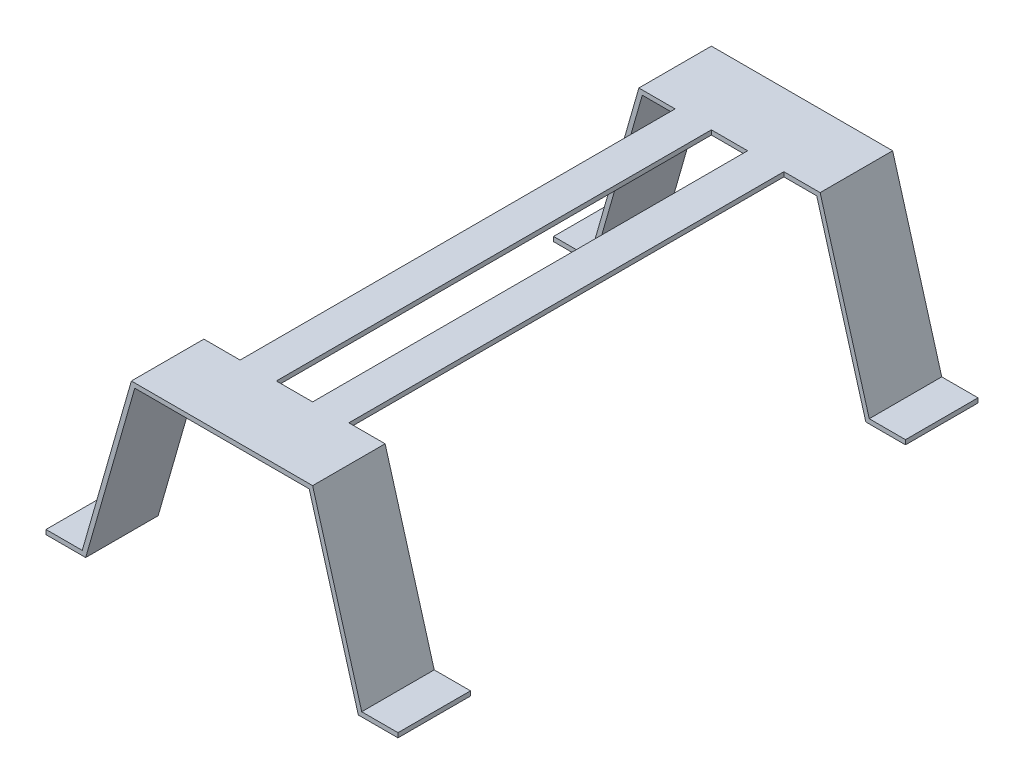
ISO-10303-21;
HEADER;
FILE_DESCRIPTION(('STEP AP214'),'2;1');
FILE_NAME('part.step','',(''),(''),'','','');
FILE_SCHEMA(('AUTOMOTIVE_DESIGN { 1 0 10303 214 1 1 1 1 }'));
ENDSEC;
DATA;
#1=APPLICATION_CONTEXT('core data for automotive mechanical design processes');
#2=APPLICATION_PROTOCOL_DEFINITION('international standard','automotive_design',2000,#1);
#3=PRODUCT_CONTEXT('',#1,'mechanical');
#4=PRODUCT('Part','Part','',(#3));
#5=PRODUCT_RELATED_PRODUCT_CATEGORY('part','',(#4));
#6=PRODUCT_DEFINITION_FORMATION('','',#4);
#7=PRODUCT_DEFINITION_CONTEXT('part definition',#1,'design');
#8=PRODUCT_DEFINITION('design','',#6,#7);
#9=PRODUCT_DEFINITION_SHAPE('','',#8);
#10=(LENGTH_UNIT() NAMED_UNIT(*) SI_UNIT(.MILLI.,.METRE.));
#11=(NAMED_UNIT(*) PLANE_ANGLE_UNIT() SI_UNIT($,.RADIAN.));
#12=(NAMED_UNIT(*) SI_UNIT($,.STERADIAN.) SOLID_ANGLE_UNIT());
#13=UNCERTAINTY_MEASURE_WITH_UNIT(LENGTH_MEASURE(1.E-05),#10,'distance_accuracy_value','');
#14=(GEOMETRIC_REPRESENTATION_CONTEXT(3) GLOBAL_UNCERTAINTY_ASSIGNED_CONTEXT((#13)) GLOBAL_UNIT_ASSIGNED_CONTEXT((#10,
#11,#12)) REPRESENTATION_CONTEXT('',''));
#15=CARTESIAN_POINT('',(0.,0.,0.));
#16=DIRECTION('',(0.,0.,1.));
#17=DIRECTION('',(1.,0.,0.));
#18=AXIS2_PLACEMENT_3D('',#15,#16,#17);
#19=CARTESIAN_POINT('',(0.,0.,50.8));
#20=DIRECTION('',(0.,0.,1.));
#21=DIRECTION('',(1.,0.,0.));
#22=AXIS2_PLACEMENT_3D('',#19,#20,#21);
#23=PLANE('',#22);
#24=DIRECTION('',(1.,0.,0.));
#25=VECTOR('',#24,1.);
#26=CARTESIAN_POINT('',(32.4151483390641,112.987830713057,50.8));
#27=LINE('',#26,#25);
#28=CARTESIAN_POINT('',(80.8226142299877,112.987830713057,50.8));
#29=VERTEX_POINT('',#28);
#30=CARTESIAN_POINT('',(106.222614229988,112.987830713057,50.8));
#31=VERTEX_POINT('',#30);
#32=EDGE_CURVE('E328',#29,#31,#27,.T.);
#33=ORIENTED_EDGE('',*,*,#32,.T.);
#34=DIRECTION('',(0.,-1.,0.));
#35=VECTOR('',#34,1.);
#36=CARTESIAN_POINT('',(106.222614229988,116.162830713057,50.8));
#37=LINE('',#36,#35);
#38=CARTESIAN_POINT('',(106.222614229988,116.162830713057,50.8));
#39=VERTEX_POINT('',#38);
#40=EDGE_CURVE('E264',#39,#31,#37,.T.);
#41=ORIENTED_EDGE('',*,*,#40,.F.);
#42=DIRECTION('',(-1.,0.,0.));
#43=VECTOR('',#42,1.);
#44=CARTESIAN_POINT('',(30.0226142299878,116.162830713057,50.8));
#45=LINE('',#44,#43);
#46=CARTESIAN_POINT('',(80.8226142299878,116.162830713057,50.8));
#47=VERTEX_POINT('',#46);
#48=EDGE_CURVE('E341',#39,#47,#45,.T.);
#49=ORIENTED_EDGE('',*,*,#48,.T.);
#50=DIRECTION('',(0.,1.,0.));
#51=VECTOR('',#50,1.);
#52=CARTESIAN_POINT('',(80.8226142299878,116.162830713057,50.8));
#53=LINE('',#52,#51);
#54=EDGE_CURVE('E296',#29,#47,#53,.T.);
#55=ORIENTED_EDGE('',*,*,#54,.F.);
#56=EDGE_LOOP('',(#33,#41,#49,#55));
#57=FACE_BOUND('',#56,.T.);
#58=ADVANCED_FACE('F32',(#57),#23,.T.);
#59=CARTESIAN_POINT('',(157.022614229988,116.162830713057,50.8));
#60=VERTEX_POINT('',#59);
#61=CARTESIAN_POINT('',(131.622614229988,116.162830713057,50.8));
#62=VERTEX_POINT('',#61);
#63=EDGE_CURVE('E47',#60,#62,#45,.T.);
#64=ORIENTED_EDGE('',*,*,#63,.T.);
#65=DIRECTION('',(0.,1.,0.));
#66=VECTOR('',#65,1.);
#67=CARTESIAN_POINT('',(131.622614229988,116.162830713057,50.8));
#68=LINE('',#67,#66);
#69=CARTESIAN_POINT('',(131.622614229988,112.987830713057,50.8));
#70=VERTEX_POINT('',#69);
#71=EDGE_CURVE('E51',#70,#62,#68,.T.);
#72=ORIENTED_EDGE('',*,*,#71,.F.);
#73=CARTESIAN_POINT('',(154.630080120911,112.987830713057,50.8));
#74=VERTEX_POINT('',#73);
#75=EDGE_CURVE('E324',#70,#74,#27,.T.);
#76=ORIENTED_EDGE('',*,*,#75,.T.);
#77=DIRECTION('',(0.275637355816996,-0.96126169593832,0.));
#78=VECTOR('',#77,1.);
#79=CARTESIAN_POINT('',(154.630080120911,112.987830713057,50.8));
#80=LINE('',#79,#78);
#81=CARTESIAN_POINT('',(189.039526411968,-7.01216928694275,50.8));
#82=VERTEX_POINT('',#81);
#83=EDGE_CURVE('E327',#74,#82,#80,.T.);
#84=ORIENTED_EDGE('',*,*,#83,.T.);
#85=DIRECTION('',(1.,0.,0.));
#86=VECTOR('',#85,1.);
#87=CARTESIAN_POINT('',(189.039526411968,-7.01216928694275,50.8));
#88=LINE('',#87,#86);
#89=CARTESIAN_POINT('',(216.832060521044,-7.01216928694275,50.8));
#90=VERTEX_POINT('',#89);
#91=EDGE_CURVE('E330',#82,#90,#88,.T.);
#92=ORIENTED_EDGE('',*,*,#91,.T.);
#93=DIRECTION('',(0.,1.,0.));
#94=VECTOR('',#93,1.);
#95=CARTESIAN_POINT('',(216.832060521044,-3.83716928694275,50.8));
#96=LINE('',#95,#94);
#97=CARTESIAN_POINT('',(216.832060521044,-3.83716928694275,50.8));
#98=VERTEX_POINT('',#97);
#99=EDGE_CURVE('E332',#90,#98,#96,.T.);
#100=ORIENTED_EDGE('',*,*,#99,.T.);
#101=DIRECTION('',(-1.,0.,0.));
#102=VECTOR('',#101,1.);
#103=CARTESIAN_POINT('',(191.432060521044,-3.83716928694275,50.8));
#104=LINE('',#103,#102);
#105=CARTESIAN_POINT('',(191.432060521044,-3.83716928694275,50.8));
#106=VERTEX_POINT('',#105);
#107=EDGE_CURVE('E334',#98,#106,#104,.T.);
#108=ORIENTED_EDGE('',*,*,#107,.T.);
#109=DIRECTION('',(-0.275637355816996,0.96126169593832,0.));
#110=VECTOR('',#109,1.);
#111=CARTESIAN_POINT('',(157.022614229988,116.162830713057,50.8));
#112=LINE('',#111,#110);
#113=EDGE_CURVE('E336',#106,#60,#112,.T.);
#114=ORIENTED_EDGE('',*,*,#113,.T.);
#115=EDGE_LOOP('',(#64,#72,#76,#84,#92,#100,#108,#114));
#116=FACE_BOUND('',#115,.T.);
#117=ADVANCED_FACE('F420',(#116),#23,.T.);
#118=DIRECTION('',(0.,-1.,0.));
#119=VECTOR('',#118,1.);
#120=CARTESIAN_POINT('',(55.4226142299878,116.162830713057,50.8));
#121=LINE('',#120,#119);
#122=CARTESIAN_POINT('',(55.4226142299878,116.162830713057,50.8));
#123=VERTEX_POINT('',#122);
#124=CARTESIAN_POINT('',(55.4226142299878,112.987830713057,50.8));
#125=VERTEX_POINT('',#124);
#126=EDGE_CURVE('E291',#123,#125,#121,.T.);
#127=ORIENTED_EDGE('',*,*,#126,.F.);
#128=CARTESIAN_POINT('',(30.0226142299878,116.162830713057,50.8));
#129=VERTEX_POINT('',#128);
#130=EDGE_CURVE('E338',#123,#129,#45,.T.);
#131=ORIENTED_EDGE('',*,*,#130,.T.);
#132=DIRECTION('',(-0.275637355816996,-0.96126169593832,0.));
#133=VECTOR('',#132,1.);
#134=CARTESIAN_POINT('',(-4.38683206106875,-3.83716928694274,50.8));
#135=LINE('',#134,#133);
#136=CARTESIAN_POINT('',(-4.38683206106875,-3.83716928694274,50.8));
#137=VERTEX_POINT('',#136);
#138=EDGE_CURVE('E340',#129,#137,#135,.T.);
#139=ORIENTED_EDGE('',*,*,#138,.T.);
#140=DIRECTION('',(-1.,0.,0.));
#141=VECTOR('',#140,1.);
#142=CARTESIAN_POINT('',(-29.7868320610688,-3.83716928694274,50.8));
#143=LINE('',#142,#141);
#144=CARTESIAN_POINT('',(-29.7868320610688,-3.83716928694274,50.8));
#145=VERTEX_POINT('',#144);
#146=EDGE_CURVE('E343',#137,#145,#143,.T.);
#147=ORIENTED_EDGE('',*,*,#146,.T.);
#148=DIRECTION('',(0.,-1.,0.));
#149=VECTOR('',#148,1.);
#150=CARTESIAN_POINT('',(-29.7868320610688,-3.83716928694274,50.8));
#151=LINE('',#150,#149);
#152=CARTESIAN_POINT('',(-29.7868320610688,-7.01216928694274,50.8));
#153=VERTEX_POINT('',#152);
#154=EDGE_CURVE('E316',#145,#153,#151,.T.);
#155=ORIENTED_EDGE('',*,*,#154,.T.);
#156=DIRECTION('',(1.,0.,0.));
#157=VECTOR('',#156,1.);
#158=CARTESIAN_POINT('',(-29.7868320610688,-7.01216928694274,50.8));
#159=LINE('',#158,#157);
#160=CARTESIAN_POINT('',(-1.99429795199238,-7.01216928694274,50.8));
#161=VERTEX_POINT('',#160);
#162=EDGE_CURVE('E319',#153,#161,#159,.T.);
#163=ORIENTED_EDGE('',*,*,#162,.T.);
#164=DIRECTION('',(0.275637355816996,0.96126169593832,0.));
#165=VECTOR('',#164,1.);
#166=CARTESIAN_POINT('',(-1.99429795199238,-7.01216928694274,50.8));
#167=LINE('',#166,#165);
#168=CARTESIAN_POINT('',(32.4151483390641,112.987830713057,50.8));
#169=VERTEX_POINT('',#168);
#170=EDGE_CURVE('E322',#161,#169,#167,.T.);
#171=ORIENTED_EDGE('',*,*,#170,.T.);
#172=EDGE_CURVE('E325',#169,#125,#27,.T.);
#173=ORIENTED_EDGE('',*,*,#172,.T.);
#174=EDGE_LOOP('',(#127,#131,#139,#147,#155,#163,#171,#173));
#175=FACE_BOUND('',#174,.T.);
#176=ADVANCED_FACE('F542',(#175),#23,.T.);
#177=CARTESIAN_POINT('',(-29.7868320610688,-3.83716928694274,50.8));
#178=DIRECTION('',(1.,0.,0.));
#179=DIRECTION('',(0.,0.,-1.));
#180=AXIS2_PLACEMENT_3D('',#177,#178,#179);
#181=PLANE('',#180);
#182=DIRECTION('',(0.,-1.,0.));
#183=VECTOR('',#182,1.);
#184=CARTESIAN_POINT('',(-29.7868320610688,-3.83716928694274,0.));
#185=LINE('',#184,#183);
#186=CARTESIAN_POINT('',(-29.7868320610688,-3.83716928694274,0.));
#187=VERTEX_POINT('',#186);
#188=CARTESIAN_POINT('',(-29.7868320610688,-7.01216928694274,0.));
#189=VERTEX_POINT('',#188);
#190=EDGE_CURVE('E315',#187,#189,#185,.T.);
#191=ORIENTED_EDGE('',*,*,#190,.T.);
#192=DIRECTION('',(0.,0.,-1.));
#193=VECTOR('',#192,1.);
#194=CARTESIAN_POINT('',(-29.7868320610688,-7.01216928694274,50.8));
#195=LINE('',#194,#193);
#196=EDGE_CURVE('E11',#153,#189,#195,.T.);
#197=ORIENTED_EDGE('',*,*,#196,.F.);
#198=ORIENTED_EDGE('',*,*,#154,.F.);
#199=DIRECTION('',(0.,0.,-1.));
#200=VECTOR('',#199,1.);
#201=CARTESIAN_POINT('',(-29.7868320610688,-3.83716928694274,50.8));
#202=LINE('',#201,#200);
#203=EDGE_CURVE('E345',#145,#187,#202,.T.);
#204=ORIENTED_EDGE('',*,*,#203,.T.);
#205=EDGE_LOOP('',(#191,#197,#198,#204));
#206=FACE_BOUND('',#205,.T.);
#207=ADVANCED_FACE('F34',(#206),#181,.F.);
#208=CARTESIAN_POINT('',(-29.7868320610688,-7.01216928694274,50.8));
#209=DIRECTION('',(0.,1.,0.));
#210=DIRECTION('',(0.,0.,1.));
#211=AXIS2_PLACEMENT_3D('',#208,#209,#210);
#212=PLANE('',#211);
#213=DIRECTION('',(1.,0.,0.));
#214=VECTOR('',#213,1.);
#215=CARTESIAN_POINT('',(-29.7868320610688,-7.01216928694274,0.));
#216=LINE('',#215,#214);
#217=CARTESIAN_POINT('',(-1.99429795199238,-7.01216928694274,0.));
#218=VERTEX_POINT('',#217);
#219=EDGE_CURVE('E348',#189,#218,#216,.T.);
#220=ORIENTED_EDGE('',*,*,#219,.T.);
#221=DIRECTION('',(0.,0.,-1.));
#222=VECTOR('',#221,1.);
#223=CARTESIAN_POINT('',(-1.99429795199238,-7.01216928694274,50.8));
#224=LINE('',#223,#222);
#225=EDGE_CURVE('E40',#161,#218,#224,.T.);
#226=ORIENTED_EDGE('',*,*,#225,.F.);
#227=ORIENTED_EDGE('',*,*,#162,.F.);
#228=ORIENTED_EDGE('',*,*,#196,.T.);
#229=EDGE_LOOP('',(#220,#226,#227,#228));
#230=FACE_BOUND('',#229,.T.);
#231=ADVANCED_FACE('F589',(#230),#212,.F.);
#232=CARTESIAN_POINT('',(-1.99429795199238,-7.01216928694274,50.8));
#233=DIRECTION('',(-0.96126169593832,0.275637355816996,0.));
#234=DIRECTION('',(-0.275637355816996,-0.96126169593832,0.));
#235=AXIS2_PLACEMENT_3D('',#232,#233,#234);
#236=PLANE('',#235);
#237=DIRECTION('',(0.275637355816996,0.96126169593832,0.));
#238=VECTOR('',#237,1.);
#239=CARTESIAN_POINT('',(-1.99429795199238,-7.01216928694274,0.));
#240=LINE('',#239,#238);
#241=CARTESIAN_POINT('',(32.4151483390641,112.987830713057,0.));
#242=VERTEX_POINT('',#241);
#243=EDGE_CURVE('E350',#218,#242,#240,.T.);
#244=ORIENTED_EDGE('',*,*,#243,.T.);
#245=DIRECTION('',(0.,0.,-1.));
#246=VECTOR('',#245,1.);
#247=CARTESIAN_POINT('',(32.4151483390641,112.987830713057,50.8));
#248=LINE('',#247,#246);
#249=EDGE_CURVE('E395',#169,#242,#248,.T.);
#250=ORIENTED_EDGE('',*,*,#249,.F.);
#251=ORIENTED_EDGE('',*,*,#170,.F.);
#252=ORIENTED_EDGE('',*,*,#225,.T.);
#253=EDGE_LOOP('',(#244,#250,#251,#252));
#254=FACE_BOUND('',#253,.T.);
#255=ADVANCED_FACE('F402',(#254),#236,.F.);
#256=CARTESIAN_POINT('',(32.4151483390641,112.987830713057,50.8));
#257=DIRECTION('',(0.,1.,0.));
#258=DIRECTION('',(0.,0.,1.));
#259=AXIS2_PLACEMENT_3D('',#256,#257,#258);
#260=PLANE('',#259);
#261=DIRECTION('',(0.,0.,-1.));
#262=VECTOR('',#261,1.);
#263=CARTESIAN_POINT('',(80.8226142299878,112.987830713057,355.6));
#264=LINE('',#263,#262);
#265=CARTESIAN_POINT('',(80.8226142299878,112.987830713057,355.6));
#266=VERTEX_POINT('',#265);
#267=EDGE_CURVE('E309',#266,#29,#264,.T.);
#268=ORIENTED_EDGE('',*,*,#267,.F.);
#269=DIRECTION('',(1.,0.,0.));
#270=VECTOR('',#269,1.);
#271=CARTESIAN_POINT('',(154.630080120911,112.987830713057,355.6));
#272=LINE('',#271,#270);
#273=CARTESIAN_POINT('',(106.222614229988,112.987830713057,355.6));
#274=VERTEX_POINT('',#273);
#275=EDGE_CURVE('E428',#266,#274,#272,.T.);
#276=ORIENTED_EDGE('',*,*,#275,.T.);
#277=DIRECTION('',(0.,0.,-1.));
#278=VECTOR('',#277,1.);
#279=CARTESIAN_POINT('',(106.222614229988,112.987830713057,355.6));
#280=LINE('',#279,#278);
#281=EDGE_CURVE('E288',#274,#31,#280,.T.);
#282=ORIENTED_EDGE('',*,*,#281,.T.);
#283=ORIENTED_EDGE('',*,*,#32,.F.);
#284=EDGE_LOOP('',(#268,#276,#282,#283));
#285=FACE_BOUND('',#284,.T.);
#286=DIRECTION('',(1.,0.,0.));
#287=VECTOR('',#286,1.);
#288=CARTESIAN_POINT('',(32.4151483390641,112.987830713057,0.));
#289=LINE('',#288,#287);
#290=CARTESIAN_POINT('',(154.630080120911,112.987830713057,0.));
#291=VERTEX_POINT('',#290);
#292=EDGE_CURVE('E352',#242,#291,#289,.T.);
#293=ORIENTED_EDGE('',*,*,#292,.T.);
#294=DIRECTION('',(0.,0.,-1.));
#295=VECTOR('',#294,1.);
#296=CARTESIAN_POINT('',(154.630080120911,112.987830713057,50.8));
#297=LINE('',#296,#295);
#298=EDGE_CURVE('E392',#74,#291,#297,.T.);
#299=ORIENTED_EDGE('',*,*,#298,.F.);
#300=ORIENTED_EDGE('',*,*,#75,.F.);
#301=DIRECTION('',(0.,0.,-1.));
#302=VECTOR('',#301,1.);
#303=CARTESIAN_POINT('',(131.622614229988,112.987830713057,355.6));
#304=LINE('',#303,#302);
#305=CARTESIAN_POINT('',(131.622614229988,112.987830713057,355.6));
#306=VERTEX_POINT('',#305);
#307=EDGE_CURVE('E285',#306,#70,#304,.T.);
#308=ORIENTED_EDGE('',*,*,#307,.F.);
#309=CARTESIAN_POINT('',(154.630080120911,112.987830713057,355.6));
#310=VERTEX_POINT('',#309);
#311=EDGE_CURVE('E490',#306,#310,#272,.T.);
#312=ORIENTED_EDGE('',*,*,#311,.T.);
#313=DIRECTION('',(0.,0.,-1.));
#314=VECTOR('',#313,1.);
#315=CARTESIAN_POINT('',(154.630080120911,112.987830713057,406.4));
#316=LINE('',#315,#314);
#317=CARTESIAN_POINT('',(154.630080120911,112.987830713057,406.4));
#318=VERTEX_POINT('',#317);
#319=EDGE_CURVE('E464',#318,#310,#316,.T.);
#320=ORIENTED_EDGE('',*,*,#319,.F.);
#321=DIRECTION('',(1.,0.,0.));
#322=VECTOR('',#321,1.);
#323=CARTESIAN_POINT('',(154.630080120911,112.987830713057,406.4));
#324=LINE('',#323,#322);
#325=CARTESIAN_POINT('',(32.4151483390641,112.987830713057,406.4));
#326=VERTEX_POINT('',#325);
#327=EDGE_CURVE('E582',#326,#318,#324,.T.);
#328=ORIENTED_EDGE('',*,*,#327,.F.);
#329=DIRECTION('',(0.,0.,-1.));
#330=VECTOR('',#329,1.);
#331=CARTESIAN_POINT('',(32.4151483390641,112.987830713057,406.4));
#332=LINE('',#331,#330);
#333=CARTESIAN_POINT('',(32.4151483390641,112.987830713057,355.6));
#334=VERTEX_POINT('',#333);
#335=EDGE_CURVE('E467',#326,#334,#332,.T.);
#336=ORIENTED_EDGE('',*,*,#335,.T.);
#337=CARTESIAN_POINT('',(55.4226142299878,112.987830713057,355.6));
#338=VERTEX_POINT('',#337);
#339=EDGE_CURVE('E496',#334,#338,#272,.T.);
#340=ORIENTED_EDGE('',*,*,#339,.T.);
#341=DIRECTION('',(0.,0.,-1.));
#342=VECTOR('',#341,1.);
#343=CARTESIAN_POINT('',(55.4226142299878,112.987830713057,355.6));
#344=LINE('',#343,#342);
#345=EDGE_CURVE('E312',#338,#125,#344,.T.);
#346=ORIENTED_EDGE('',*,*,#345,.T.);
#347=ORIENTED_EDGE('',*,*,#172,.F.);
#348=ORIENTED_EDGE('',*,*,#249,.T.);
#349=EDGE_LOOP('',(#293,#299,#300,#308,#312,#320,#328,#336,#340,#346,#347,#348));
#350=FACE_BOUND('',#349,.T.);
#351=ADVANCED_FACE('F413',(#285,#350),#260,.F.);
#352=CARTESIAN_POINT('',(154.630080120911,112.987830713057,50.8));
#353=DIRECTION('',(0.96126169593832,0.275637355816996,0.));
#354=DIRECTION('',(-0.275637355816996,0.96126169593832,0.));
#355=AXIS2_PLACEMENT_3D('',#352,#353,#354);
#356=PLANE('',#355);
#357=DIRECTION('',(0.275637355816996,-0.96126169593832,0.));
#358=VECTOR('',#357,1.);
#359=CARTESIAN_POINT('',(154.630080120911,112.987830713057,0.));
#360=LINE('',#359,#358);
#361=CARTESIAN_POINT('',(189.039526411968,-7.01216928694275,0.));
#362=VERTEX_POINT('',#361);
#363=EDGE_CURVE('E354',#291,#362,#360,.T.);
#364=ORIENTED_EDGE('',*,*,#363,.T.);
#365=DIRECTION('',(0.,0.,-1.));
#366=VECTOR('',#365,1.);
#367=CARTESIAN_POINT('',(189.039526411968,-7.01216928694275,50.8));
#368=LINE('',#367,#366);
#369=EDGE_CURVE('E389',#82,#362,#368,.T.);
#370=ORIENTED_EDGE('',*,*,#369,.F.);
#371=ORIENTED_EDGE('',*,*,#83,.F.);
#372=ORIENTED_EDGE('',*,*,#298,.T.);
#373=EDGE_LOOP('',(#364,#370,#371,#372));
#374=FACE_BOUND('',#373,.T.);
#375=ADVANCED_FACE('F417',(#374),#356,.F.);
#376=CARTESIAN_POINT('',(189.039526411968,-7.01216928694275,50.8));
#377=DIRECTION('',(0.,1.,0.));
#378=DIRECTION('',(0.,0.,1.));
#379=AXIS2_PLACEMENT_3D('',#376,#377,#378);
#380=PLANE('',#379);
#381=DIRECTION('',(1.,0.,0.));
#382=VECTOR('',#381,1.);
#383=CARTESIAN_POINT('',(189.039526411968,-7.01216928694275,0.));
#384=LINE('',#383,#382);
#385=CARTESIAN_POINT('',(216.832060521044,-7.01216928694275,0.));
#386=VERTEX_POINT('',#385);
#387=EDGE_CURVE('E356',#362,#386,#384,.T.);
#388=ORIENTED_EDGE('',*,*,#387,.T.);
#389=DIRECTION('',(0.,0.,-1.));
#390=VECTOR('',#389,1.);
#391=CARTESIAN_POINT('',(216.832060521044,-7.01216928694275,50.8));
#392=LINE('',#391,#390);
#393=EDGE_CURVE('E386',#90,#386,#392,.T.);
#394=ORIENTED_EDGE('',*,*,#393,.F.);
#395=ORIENTED_EDGE('',*,*,#91,.F.);
#396=ORIENTED_EDGE('',*,*,#369,.T.);
#397=EDGE_LOOP('',(#388,#394,#395,#396));
#398=FACE_BOUND('',#397,.T.);
#399=ADVANCED_FACE('F622',(#398),#380,.F.);
#400=CARTESIAN_POINT('',(216.832060521044,-3.83716928694275,50.8));
#401=DIRECTION('',(-1.,0.,0.));
#402=DIRECTION('',(0.,0.,1.));
#403=AXIS2_PLACEMENT_3D('',#400,#401,#402);
#404=PLANE('',#403);
#405=DIRECTION('',(0.,1.,0.));
#406=VECTOR('',#405,1.);
#407=CARTESIAN_POINT('',(216.832060521044,-3.83716928694275,0.));
#408=LINE('',#407,#406);
#409=CARTESIAN_POINT('',(216.832060521044,-3.83716928694275,0.));
#410=VERTEX_POINT('',#409);
#411=EDGE_CURVE('E358',#386,#410,#408,.T.);
#412=ORIENTED_EDGE('',*,*,#411,.T.);
#413=DIRECTION('',(0.,0.,-1.));
#414=VECTOR('',#413,1.);
#415=CARTESIAN_POINT('',(216.832060521044,-3.83716928694275,50.8));
#416=LINE('',#415,#414);
#417=EDGE_CURVE('E383',#98,#410,#416,.T.);
#418=ORIENTED_EDGE('',*,*,#417,.F.);
#419=ORIENTED_EDGE('',*,*,#99,.F.);
#420=ORIENTED_EDGE('',*,*,#393,.T.);
#421=EDGE_LOOP('',(#412,#418,#419,#420));
#422=FACE_BOUND('',#421,.T.);
#423=ADVANCED_FACE('F618',(#422),#404,.F.);
#424=CARTESIAN_POINT('',(191.432060521044,-3.83716928694275,50.8));
#425=DIRECTION('',(0.,-1.,0.));
#426=DIRECTION('',(0.,0.,-1.));
#427=AXIS2_PLACEMENT_3D('',#424,#425,#426);
#428=PLANE('',#427);
#429=DIRECTION('',(-1.,0.,0.));
#430=VECTOR('',#429,1.);
#431=CARTESIAN_POINT('',(191.432060521044,-3.83716928694275,0.));
#432=LINE('',#431,#430);
#433=CARTESIAN_POINT('',(191.432060521044,-3.83716928694275,0.));
#434=VERTEX_POINT('',#433);
#435=EDGE_CURVE('E360',#410,#434,#432,.T.);
#436=ORIENTED_EDGE('',*,*,#435,.T.);
#437=DIRECTION('',(0.,0.,-1.));
#438=VECTOR('',#437,1.);
#439=CARTESIAN_POINT('',(191.432060521044,-3.83716928694275,50.8));
#440=LINE('',#439,#438);
#441=EDGE_CURVE('E380',#106,#434,#440,.T.);
#442=ORIENTED_EDGE('',*,*,#441,.F.);
#443=ORIENTED_EDGE('',*,*,#107,.F.);
#444=ORIENTED_EDGE('',*,*,#417,.T.);
#445=EDGE_LOOP('',(#436,#442,#443,#444));
#446=FACE_BOUND('',#445,.T.);
#447=ADVANCED_FACE('F615',(#446),#428,.F.);
#448=CARTESIAN_POINT('',(157.022614229988,116.162830713057,50.8));
#449=DIRECTION('',(-0.96126169593832,-0.275637355816996,0.));
#450=DIRECTION('',(0.275637355816996,-0.96126169593832,0.));
#451=AXIS2_PLACEMENT_3D('',#448,#449,#450);
#452=PLANE('',#451);
#453=DIRECTION('',(-0.275637355816996,0.96126169593832,0.));
#454=VECTOR('',#453,1.);
#455=CARTESIAN_POINT('',(157.022614229988,116.162830713057,0.));
#456=LINE('',#455,#454);
#457=CARTESIAN_POINT('',(157.022614229988,116.162830713057,0.));
#458=VERTEX_POINT('',#457);
#459=EDGE_CURVE('E362',#434,#458,#456,.T.);
#460=ORIENTED_EDGE('',*,*,#459,.T.);
#461=DIRECTION('',(0.,0.,-1.));
#462=VECTOR('',#461,1.);
#463=CARTESIAN_POINT('',(157.022614229988,116.162830713057,50.8));
#464=LINE('',#463,#462);
#465=EDGE_CURVE('E377',#60,#458,#464,.T.);
#466=ORIENTED_EDGE('',*,*,#465,.F.);
#467=ORIENTED_EDGE('',*,*,#113,.F.);
#468=ORIENTED_EDGE('',*,*,#441,.T.);
#469=EDGE_LOOP('',(#460,#466,#467,#468));
#470=FACE_BOUND('',#469,.T.);
#471=ADVANCED_FACE('F612',(#470),#452,.F.);
#472=CARTESIAN_POINT('',(30.0226142299878,116.162830713057,50.8));
#473=DIRECTION('',(0.,-1.,0.));
#474=DIRECTION('',(1.,0.,0.));
#475=AXIS2_PLACEMENT_3D('',#472,#473,#474);
#476=PLANE('',#475);
#477=DIRECTION('',(0.,0.,-1.));
#478=VECTOR('',#477,1.);
#479=CARTESIAN_POINT('',(55.4226142299878,116.162830713057,355.6));
#480=LINE('',#479,#478);
#481=CARTESIAN_POINT('',(55.4226142299878,116.162830713057,355.6));
#482=VERTEX_POINT('',#481);
#483=EDGE_CURVE('E299',#482,#123,#480,.T.);
#484=ORIENTED_EDGE('',*,*,#483,.F.);
#485=DIRECTION('',(-1.,0.,0.));
#486=VECTOR('',#485,1.);
#487=CARTESIAN_POINT('',(30.0226142299878,116.162830713057,355.6));
#488=LINE('',#487,#486);
#489=CARTESIAN_POINT('',(30.0226142299878,116.162830713057,355.6));
#490=VERTEX_POINT('',#489);
#491=EDGE_CURVE('E440',#482,#490,#488,.T.);
#492=ORIENTED_EDGE('',*,*,#491,.T.);
#493=DIRECTION('',(0.,0.,-1.));
#494=VECTOR('',#493,1.);
#495=CARTESIAN_POINT('',(30.0226142299878,116.162830713057,406.4));
#496=LINE('',#495,#494);
#497=CARTESIAN_POINT('',(30.0226142299878,116.162830713057,406.4));
#498=VERTEX_POINT('',#497);
#499=EDGE_CURVE('E447',#498,#490,#496,.T.);
#500=ORIENTED_EDGE('',*,*,#499,.F.);
#501=DIRECTION('',(-1.,0.,0.));
#502=VECTOR('',#501,1.);
#503=CARTESIAN_POINT('',(30.0226142299878,116.162830713057,406.4));
#504=LINE('',#503,#502);
#505=CARTESIAN_POINT('',(157.022614229988,116.162830713057,406.4));
#506=VERTEX_POINT('',#505);
#507=EDGE_CURVE('E255',#506,#498,#504,.T.);
#508=ORIENTED_EDGE('',*,*,#507,.F.);
#509=DIRECTION('',(0.,0.,-1.));
#510=VECTOR('',#509,1.);
#511=CARTESIAN_POINT('',(157.022614229988,116.162830713057,406.4));
#512=LINE('',#511,#510);
#513=CARTESIAN_POINT('',(157.022614229988,116.162830713057,355.6));
#514=VERTEX_POINT('',#513);
#515=EDGE_CURVE('E449',#506,#514,#512,.T.);
#516=ORIENTED_EDGE('',*,*,#515,.T.);
#517=CARTESIAN_POINT('',(131.622614229988,116.162830713057,355.6));
#518=VERTEX_POINT('',#517);
#519=EDGE_CURVE('E259',#514,#518,#488,.T.);
#520=ORIENTED_EDGE('',*,*,#519,.T.);
#521=DIRECTION('',(0.,0.,-1.));
#522=VECTOR('',#521,1.);
#523=CARTESIAN_POINT('',(131.622614229988,116.162830713057,355.6));
#524=LINE('',#523,#522);
#525=EDGE_CURVE('E282',#518,#62,#524,.T.);
#526=ORIENTED_EDGE('',*,*,#525,.T.);
#527=ORIENTED_EDGE('',*,*,#63,.F.);
#528=ORIENTED_EDGE('',*,*,#465,.T.);
#529=DIRECTION('',(-1.,0.,0.));
#530=VECTOR('',#529,1.);
#531=CARTESIAN_POINT('',(30.0226142299878,116.162830713057,0.));
#532=LINE('',#531,#530);
#533=CARTESIAN_POINT('',(30.0226142299878,116.162830713057,0.));
#534=VERTEX_POINT('',#533);
#535=EDGE_CURVE('E364',#458,#534,#532,.T.);
#536=ORIENTED_EDGE('',*,*,#535,.T.);
#537=DIRECTION('',(0.,0.,-1.));
#538=VECTOR('',#537,1.);
#539=CARTESIAN_POINT('',(30.0226142299878,116.162830713057,50.8));
#540=LINE('',#539,#538);
#541=EDGE_CURVE('E374',#129,#534,#540,.T.);
#542=ORIENTED_EDGE('',*,*,#541,.F.);
#543=ORIENTED_EDGE('',*,*,#130,.F.);
#544=EDGE_LOOP('',(#484,#492,#500,#508,#516,#520,#526,#527,#528,#536,#542,#543));
#545=FACE_BOUND('',#544,.T.);
#546=CARTESIAN_POINT('',(106.222614229988,116.162830713057,355.6));
#547=VERTEX_POINT('',#546);
#548=CARTESIAN_POINT('',(80.8226142299878,116.162830713057,355.6));
#549=VERTEX_POINT('',#548);
#550=EDGE_CURVE('E436',#547,#549,#488,.T.);
#551=ORIENTED_EDGE('',*,*,#550,.T.);
#552=DIRECTION('',(0.,0.,-1.));
#553=VECTOR('',#552,1.);
#554=CARTESIAN_POINT('',(80.8226142299878,116.162830713057,355.6));
#555=LINE('',#554,#553);
#556=EDGE_CURVE('E306',#549,#47,#555,.T.);
#557=ORIENTED_EDGE('',*,*,#556,.T.);
#558=ORIENTED_EDGE('',*,*,#48,.F.);
#559=DIRECTION('',(0.,0.,-1.));
#560=VECTOR('',#559,1.);
#561=CARTESIAN_POINT('',(106.222614229988,116.162830713057,355.6));
#562=LINE('',#561,#560);
#563=EDGE_CURVE('E277',#547,#39,#562,.T.);
#564=ORIENTED_EDGE('',*,*,#563,.F.);
#565=EDGE_LOOP('',(#551,#557,#558,#564));
#566=FACE_BOUND('',#565,.T.);
#567=ADVANCED_FACE('F435',(#545,#566),#476,.F.);
#568=CARTESIAN_POINT('',(-4.38683206106875,-3.83716928694274,50.8));
#569=DIRECTION('',(0.96126169593832,-0.275637355816996,0.));
#570=DIRECTION('',(0.275637355816996,0.96126169593832,0.));
#571=AXIS2_PLACEMENT_3D('',#568,#569,#570);
#572=PLANE('',#571);
#573=DIRECTION('',(-0.275637355816996,-0.96126169593832,0.));
#574=VECTOR('',#573,1.);
#575=CARTESIAN_POINT('',(-4.38683206106875,-3.83716928694274,0.));
#576=LINE('',#575,#574);
#577=CARTESIAN_POINT('',(-4.38683206106875,-3.83716928694274,0.));
#578=VERTEX_POINT('',#577);
#579=EDGE_CURVE('E366',#534,#578,#576,.T.);
#580=ORIENTED_EDGE('',*,*,#579,.T.);
#581=DIRECTION('',(0.,0.,-1.));
#582=VECTOR('',#581,1.);
#583=CARTESIAN_POINT('',(-4.38683206106875,-3.83716928694274,50.8));
#584=LINE('',#583,#582);
#585=EDGE_CURVE('E371',#137,#578,#584,.T.);
#586=ORIENTED_EDGE('',*,*,#585,.F.);
#587=ORIENTED_EDGE('',*,*,#138,.F.);
#588=ORIENTED_EDGE('',*,*,#541,.T.);
#589=EDGE_LOOP('',(#580,#586,#587,#588));
#590=FACE_BOUND('',#589,.T.);
#591=ADVANCED_FACE('F534',(#590),#572,.F.);
#592=CARTESIAN_POINT('',(-29.7868320610688,-3.83716928694274,50.8));
#593=DIRECTION('',(0.,-1.,0.));
#594=DIRECTION('',(0.,0.,-1.));
#595=AXIS2_PLACEMENT_3D('',#592,#593,#594);
#596=PLANE('',#595);
#597=DIRECTION('',(-1.,0.,0.));
#598=VECTOR('',#597,1.);
#599=CARTESIAN_POINT('',(-29.7868320610688,-3.83716928694274,0.));
#600=LINE('',#599,#598);
#601=EDGE_CURVE('E320',#578,#187,#600,.T.);
#602=ORIENTED_EDGE('',*,*,#601,.T.);
#603=ORIENTED_EDGE('',*,*,#203,.F.);
#604=ORIENTED_EDGE('',*,*,#146,.F.);
#605=ORIENTED_EDGE('',*,*,#585,.T.);
#606=EDGE_LOOP('',(#602,#603,#604,#605));
#607=FACE_BOUND('',#606,.T.);
#608=ADVANCED_FACE('F538',(#607),#596,.F.);
#609=CARTESIAN_POINT('',(0.,0.,0.));
#610=DIRECTION('',(0.,0.,1.));
#611=DIRECTION('',(1.,0.,0.));
#612=AXIS2_PLACEMENT_3D('',#609,#610,#611);
#613=PLANE('',#612);
#614=ORIENTED_EDGE('',*,*,#190,.F.);
#615=ORIENTED_EDGE('',*,*,#601,.F.);
#616=ORIENTED_EDGE('',*,*,#579,.F.);
#617=ORIENTED_EDGE('',*,*,#535,.F.);
#618=ORIENTED_EDGE('',*,*,#459,.F.);
#619=ORIENTED_EDGE('',*,*,#435,.F.);
#620=ORIENTED_EDGE('',*,*,#411,.F.);
#621=ORIENTED_EDGE('',*,*,#387,.F.);
#622=ORIENTED_EDGE('',*,*,#363,.F.);
#623=ORIENTED_EDGE('',*,*,#292,.F.);
#624=ORIENTED_EDGE('',*,*,#243,.F.);
#625=ORIENTED_EDGE('',*,*,#219,.F.);
#626=EDGE_LOOP('',(#614,#615,#616,#617,#618,#619,#620,#621,#622,#623,#624,#625));
#627=FACE_BOUND('',#626,.T.);
#628=ADVANCED_FACE('F408',(#627),#613,.F.);
#629=CARTESIAN_POINT('',(55.4226142299878,116.162830713057,355.6));
#630=DIRECTION('',(1.,0.,0.));
#631=DIRECTION('',(0.,0.,-1.));
#632=AXIS2_PLACEMENT_3D('',#629,#630,#631);
#633=PLANE('',#632);
#634=ORIENTED_EDGE('',*,*,#126,.T.);
#635=ORIENTED_EDGE('',*,*,#345,.F.);
#636=DIRECTION('',(0.,-1.,0.));
#637=VECTOR('',#636,1.);
#638=CARTESIAN_POINT('',(55.4226142299878,116.162830713057,355.6));
#639=LINE('',#638,#637);
#640=EDGE_CURVE('E292',#482,#338,#639,.T.);
#641=ORIENTED_EDGE('',*,*,#640,.F.);
#642=ORIENTED_EDGE('',*,*,#483,.T.);
#643=EDGE_LOOP('',(#634,#635,#641,#642));
#644=FACE_BOUND('',#643,.T.);
#645=ADVANCED_FACE('F588',(#644),#633,.F.);
#646=CARTESIAN_POINT('',(80.8226142299878,116.162830713057,355.6));
#647=DIRECTION('',(-1.,0.,0.));
#648=DIRECTION('',(0.,0.,1.));
#649=AXIS2_PLACEMENT_3D('',#646,#647,#648);
#650=PLANE('',#649);
#651=ORIENTED_EDGE('',*,*,#54,.T.);
#652=ORIENTED_EDGE('',*,*,#556,.F.);
#653=DIRECTION('',(0.,1.,0.));
#654=VECTOR('',#653,1.);
#655=CARTESIAN_POINT('',(80.8226142299878,116.162830713057,355.6));
#656=LINE('',#655,#654);
#657=EDGE_CURVE('E295',#266,#549,#656,.T.);
#658=ORIENTED_EDGE('',*,*,#657,.F.);
#659=ORIENTED_EDGE('',*,*,#267,.T.);
#660=EDGE_LOOP('',(#651,#652,#658,#659));
#661=FACE_BOUND('',#660,.T.);
#662=ADVANCED_FACE('F546',(#661),#650,.F.);
#663=CARTESIAN_POINT('',(106.222614229988,116.162830713057,355.6));
#664=DIRECTION('',(1.,0.,0.));
#665=DIRECTION('',(0.,0.,-1.));
#666=AXIS2_PLACEMENT_3D('',#663,#664,#665);
#667=PLANE('',#666);
#668=ORIENTED_EDGE('',*,*,#40,.T.);
#669=ORIENTED_EDGE('',*,*,#281,.F.);
#670=DIRECTION('',(0.,-1.,0.));
#671=VECTOR('',#670,1.);
#672=CARTESIAN_POINT('',(106.222614229988,116.162830713057,355.6));
#673=LINE('',#672,#671);
#674=EDGE_CURVE('E272',#547,#274,#673,.T.);
#675=ORIENTED_EDGE('',*,*,#674,.F.);
#676=ORIENTED_EDGE('',*,*,#563,.T.);
#677=EDGE_LOOP('',(#668,#669,#675,#676));
#678=FACE_BOUND('',#677,.T.);
#679=ADVANCED_FACE('F430',(#678),#667,.F.);
#680=CARTESIAN_POINT('',(131.622614229988,116.162830713057,355.6));
#681=DIRECTION('',(-1.,0.,0.));
#682=DIRECTION('',(0.,0.,1.));
#683=AXIS2_PLACEMENT_3D('',#680,#681,#682);
#684=PLANE('',#683);
#685=ORIENTED_EDGE('',*,*,#71,.T.);
#686=ORIENTED_EDGE('',*,*,#525,.F.);
#687=DIRECTION('',(0.,1.,0.));
#688=VECTOR('',#687,1.);
#689=CARTESIAN_POINT('',(131.622614229988,116.162830713057,355.6));
#690=LINE('',#689,#688);
#691=EDGE_CURVE('E275',#306,#518,#690,.T.);
#692=ORIENTED_EDGE('',*,*,#691,.F.);
#693=ORIENTED_EDGE('',*,*,#307,.T.);
#694=EDGE_LOOP('',(#685,#686,#692,#693));
#695=FACE_BOUND('',#694,.T.);
#696=ADVANCED_FACE('F522',(#695),#684,.F.);
#697=CARTESIAN_POINT('',(0.,0.,355.6));
#698=DIRECTION('',(0.,0.,-1.));
#699=DIRECTION('',(-1.,0.,0.));
#700=AXIS2_PLACEMENT_3D('',#697,#698,#699);
#701=PLANE('',#700);
#702=ORIENTED_EDGE('',*,*,#640,.T.);
#703=ORIENTED_EDGE('',*,*,#339,.F.);
#704=DIRECTION('',(0.275637355816996,0.96126169593832,0.));
#705=VECTOR('',#704,1.);
#706=CARTESIAN_POINT('',(32.4151483390641,112.987830713057,355.6));
#707=LINE('',#706,#705);
#708=CARTESIAN_POINT('',(-1.99429795199238,-7.01216928694274,355.6));
#709=VERTEX_POINT('',#708);
#710=EDGE_CURVE('E488',#709,#334,#707,.T.);
#711=ORIENTED_EDGE('',*,*,#710,.F.);
#712=DIRECTION('',(1.,0.,0.));
#713=VECTOR('',#712,1.);
#714=CARTESIAN_POINT('',(-1.99429795199238,-7.01216928694274,355.6));
#715=LINE('',#714,#713);
#716=CARTESIAN_POINT('',(-29.7868320610688,-7.01216928694274,355.6));
#717=VERTEX_POINT('',#716);
#718=EDGE_CURVE('E479',#717,#709,#715,.T.);
#719=ORIENTED_EDGE('',*,*,#718,.F.);
#720=DIRECTION('',(0.,-1.,0.));
#721=VECTOR('',#720,1.);
#722=CARTESIAN_POINT('',(-29.7868320610688,-7.01216928694274,355.6));
#723=LINE('',#722,#721);
#724=CARTESIAN_POINT('',(-29.7868320610688,-3.83716928694274,355.6));
#725=VERTEX_POINT('',#724);
#726=EDGE_CURVE('E486',#725,#717,#723,.T.);
#727=ORIENTED_EDGE('',*,*,#726,.F.);
#728=DIRECTION('',(-1.,0.,0.));
#729=VECTOR('',#728,1.);
#730=CARTESIAN_POINT('',(-29.7868320610688,-3.83716928694274,355.6));
#731=LINE('',#730,#729);
#732=CARTESIAN_POINT('',(-4.38683206106875,-3.83716928694274,355.6));
#733=VERTEX_POINT('',#732);
#734=EDGE_CURVE('E492',#733,#725,#731,.T.);
#735=ORIENTED_EDGE('',*,*,#734,.F.);
#736=DIRECTION('',(-0.275637355816996,-0.96126169593832,0.));
#737=VECTOR('',#736,1.);
#738=CARTESIAN_POINT('',(-4.38683206106875,-3.83716928694274,355.6));
#739=LINE('',#738,#737);
#740=EDGE_CURVE('E263',#490,#733,#739,.T.);
#741=ORIENTED_EDGE('',*,*,#740,.F.);
#742=ORIENTED_EDGE('',*,*,#491,.F.);
#743=EDGE_LOOP('',(#702,#703,#711,#719,#727,#735,#741,#742));
#744=FACE_BOUND('',#743,.T.);
#745=ADVANCED_FACE('F485',(#744),#701,.T.);
#746=ORIENTED_EDGE('',*,*,#657,.T.);
#747=ORIENTED_EDGE('',*,*,#550,.F.);
#748=ORIENTED_EDGE('',*,*,#674,.T.);
#749=ORIENTED_EDGE('',*,*,#275,.F.);
#750=EDGE_LOOP('',(#746,#747,#748,#749));
#751=FACE_BOUND('',#750,.T.);
#752=ADVANCED_FACE('F438',(#751),#701,.T.);
#753=ORIENTED_EDGE('',*,*,#691,.T.);
#754=ORIENTED_EDGE('',*,*,#519,.F.);
#755=DIRECTION('',(-0.275637355816996,0.96126169593832,0.));
#756=VECTOR('',#755,1.);
#757=CARTESIAN_POINT('',(157.022614229988,116.162830713057,355.6));
#758=LINE('',#757,#756);
#759=CARTESIAN_POINT('',(191.432060521044,-3.83716928694275,355.6));
#760=VERTEX_POINT('',#759);
#761=EDGE_CURVE('E443',#760,#514,#758,.T.);
#762=ORIENTED_EDGE('',*,*,#761,.F.);
#763=DIRECTION('',(-1.,0.,0.));
#764=VECTOR('',#763,1.);
#765=CARTESIAN_POINT('',(191.432060521044,-3.83716928694275,355.6));
#766=LINE('',#765,#764);
#767=CARTESIAN_POINT('',(216.832060521044,-3.83716928694275,355.6));
#768=VERTEX_POINT('',#767);
#769=EDGE_CURVE('E504',#768,#760,#766,.T.);
#770=ORIENTED_EDGE('',*,*,#769,.F.);
#771=DIRECTION('',(0.,1.,0.));
#772=VECTOR('',#771,1.);
#773=CARTESIAN_POINT('',(216.832060521044,-3.83716928694275,355.6));
#774=LINE('',#773,#772);
#775=CARTESIAN_POINT('',(216.832060521044,-7.01216928694275,355.6));
#776=VERTEX_POINT('',#775);
#777=EDGE_CURVE('E503',#776,#768,#774,.T.);
#778=ORIENTED_EDGE('',*,*,#777,.F.);
#779=DIRECTION('',(1.,0.,0.));
#780=VECTOR('',#779,1.);
#781=CARTESIAN_POINT('',(216.832060521044,-7.01216928694275,355.6));
#782=LINE('',#781,#780);
#783=CARTESIAN_POINT('',(189.039526411968,-7.01216928694275,355.6));
#784=VERTEX_POINT('',#783);
#785=EDGE_CURVE('E501',#784,#776,#782,.T.);
#786=ORIENTED_EDGE('',*,*,#785,.F.);
#787=DIRECTION('',(0.275637355816996,-0.96126169593832,0.));
#788=VECTOR('',#787,1.);
#789=CARTESIAN_POINT('',(189.039526411968,-7.01216928694275,355.6));
#790=LINE('',#789,#788);
#791=EDGE_CURVE('E499',#310,#784,#790,.T.);
#792=ORIENTED_EDGE('',*,*,#791,.F.);
#793=ORIENTED_EDGE('',*,*,#311,.F.);
#794=EDGE_LOOP('',(#753,#754,#762,#770,#778,#786,#792,#793));
#795=FACE_BOUND('',#794,.T.);
#796=ADVANCED_FACE('F517',(#795),#701,.T.);
#797=CARTESIAN_POINT('',(-4.38683206106875,-3.83716928694274,406.4));
#798=DIRECTION('',(0.96126169593832,-0.275637355816996,0.));
#799=DIRECTION('',(0.275637355816996,0.96126169593832,0.));
#800=AXIS2_PLACEMENT_3D('',#797,#798,#799);
#801=PLANE('',#800);
#802=ORIENTED_EDGE('',*,*,#740,.T.);
#803=DIRECTION('',(0.,0.,-1.));
#804=VECTOR('',#803,1.);
#805=CARTESIAN_POINT('',(-4.38683206106875,-3.83716928694274,406.4));
#806=LINE('',#805,#804);
#807=CARTESIAN_POINT('',(-4.38683206106875,-3.83716928694274,406.4));
#808=VERTEX_POINT('',#807);
#809=EDGE_CURVE('E243',#808,#733,#806,.T.);
#810=ORIENTED_EDGE('',*,*,#809,.F.);
#811=DIRECTION('',(-0.275637355816996,-0.96126169593832,0.));
#812=VECTOR('',#811,1.);
#813=CARTESIAN_POINT('',(-4.38683206106875,-3.83716928694274,406.4));
#814=LINE('',#813,#812);
#815=EDGE_CURVE('E250',#498,#808,#814,.T.);
#816=ORIENTED_EDGE('',*,*,#815,.F.);
#817=ORIENTED_EDGE('',*,*,#499,.T.);
#818=EDGE_LOOP('',(#802,#810,#816,#817));
#819=FACE_BOUND('',#818,.T.);
#820=ADVANCED_FACE('F261',(#819),#801,.F.);
#821=CARTESIAN_POINT('',(-29.7868320610688,-3.83716928694274,406.4));
#822=DIRECTION('',(0.,-1.,0.));
#823=DIRECTION('',(0.,0.,-1.));
#824=AXIS2_PLACEMENT_3D('',#821,#822,#823);
#825=PLANE('',#824);
#826=ORIENTED_EDGE('',*,*,#734,.T.);
#827=DIRECTION('',(0.,0.,-1.));
#828=VECTOR('',#827,1.);
#829=CARTESIAN_POINT('',(-29.7868320610688,-3.83716928694274,406.4));
#830=LINE('',#829,#828);
#831=CARTESIAN_POINT('',(-29.7868320610688,-3.83716928694274,406.4));
#832=VERTEX_POINT('',#831);
#833=EDGE_CURVE('E246',#832,#725,#830,.T.);
#834=ORIENTED_EDGE('',*,*,#833,.F.);
#835=DIRECTION('',(-1.,0.,0.));
#836=VECTOR('',#835,1.);
#837=CARTESIAN_POINT('',(-29.7868320610688,-3.83716928694274,406.4));
#838=LINE('',#837,#836);
#839=EDGE_CURVE('E239',#808,#832,#838,.T.);
#840=ORIENTED_EDGE('',*,*,#839,.F.);
#841=ORIENTED_EDGE('',*,*,#809,.T.);
#842=EDGE_LOOP('',(#826,#834,#840,#841));
#843=FACE_BOUND('',#842,.T.);
#844=ADVANCED_FACE('F241',(#843),#825,.F.);
#845=CARTESIAN_POINT('',(-29.7868320610688,-7.01216928694274,406.4));
#846=DIRECTION('',(1.,0.,0.));
#847=DIRECTION('',(0.,0.,-1.));
#848=AXIS2_PLACEMENT_3D('',#845,#846,#847);
#849=PLANE('',#848);
#850=ORIENTED_EDGE('',*,*,#726,.T.);
#851=DIRECTION('',(0.,0.,-1.));
#852=VECTOR('',#851,1.);
#853=CARTESIAN_POINT('',(-29.7868320610688,-7.01216928694274,406.4));
#854=LINE('',#853,#852);
#855=CARTESIAN_POINT('',(-29.7868320610688,-7.01216928694274,406.4));
#856=VERTEX_POINT('',#855);
#857=EDGE_CURVE('E268',#856,#717,#854,.T.);
#858=ORIENTED_EDGE('',*,*,#857,.F.);
#859=DIRECTION('',(0.,-1.,0.));
#860=VECTOR('',#859,1.);
#861=CARTESIAN_POINT('',(-29.7868320610688,-7.01216928694274,406.4));
#862=LINE('',#861,#860);
#863=EDGE_CURVE('E249',#832,#856,#862,.T.);
#864=ORIENTED_EDGE('',*,*,#863,.F.);
#865=ORIENTED_EDGE('',*,*,#833,.T.);
#866=EDGE_LOOP('',(#850,#858,#864,#865));
#867=FACE_BOUND('',#866,.T.);
#868=ADVANCED_FACE('F576',(#867),#849,.F.);
#869=CARTESIAN_POINT('',(-1.99429795199238,-7.01216928694274,406.4));
#870=DIRECTION('',(0.,1.,0.));
#871=DIRECTION('',(0.,0.,1.));
#872=AXIS2_PLACEMENT_3D('',#869,#870,#871);
#873=PLANE('',#872);
#874=ORIENTED_EDGE('',*,*,#718,.T.);
#875=DIRECTION('',(0.,0.,-1.));
#876=VECTOR('',#875,1.);
#877=CARTESIAN_POINT('',(-1.99429795199238,-7.01216928694274,406.4));
#878=LINE('',#877,#876);
#879=CARTESIAN_POINT('',(-1.99429795199238,-7.01216928694274,406.4));
#880=VERTEX_POINT('',#879);
#881=EDGE_CURVE('E470',#880,#709,#878,.T.);
#882=ORIENTED_EDGE('',*,*,#881,.F.);
#883=DIRECTION('',(1.,0.,0.));
#884=VECTOR('',#883,1.);
#885=CARTESIAN_POINT('',(-1.99429795199238,-7.01216928694274,406.4));
#886=LINE('',#885,#884);
#887=EDGE_CURVE('E480',#856,#880,#886,.T.);
#888=ORIENTED_EDGE('',*,*,#887,.F.);
#889=ORIENTED_EDGE('',*,*,#857,.T.);
#890=EDGE_LOOP('',(#874,#882,#888,#889));
#891=FACE_BOUND('',#890,.T.);
#892=ADVANCED_FACE('F477',(#891),#873,.F.);
#893=CARTESIAN_POINT('',(32.4151483390641,112.987830713057,406.4));
#894=DIRECTION('',(-0.96126169593832,0.275637355816996,0.));
#895=DIRECTION('',(-0.275637355816996,-0.96126169593832,0.));
#896=AXIS2_PLACEMENT_3D('',#893,#894,#895);
#897=PLANE('',#896);
#898=ORIENTED_EDGE('',*,*,#710,.T.);
#899=ORIENTED_EDGE('',*,*,#335,.F.);
#900=DIRECTION('',(0.275637355816996,0.96126169593832,0.));
#901=VECTOR('',#900,1.);
#902=CARTESIAN_POINT('',(32.4151483390641,112.987830713057,406.4));
#903=LINE('',#902,#901);
#904=EDGE_CURVE('E578',#880,#326,#903,.T.);
#905=ORIENTED_EDGE('',*,*,#904,.F.);
#906=ORIENTED_EDGE('',*,*,#881,.T.);
#907=EDGE_LOOP('',(#898,#899,#905,#906));
#908=FACE_BOUND('',#907,.T.);
#909=ADVANCED_FACE('F739',(#908),#897,.F.);
#910=CARTESIAN_POINT('',(189.039526411968,-7.01216928694275,406.4));
#911=DIRECTION('',(0.96126169593832,0.275637355816996,0.));
#912=DIRECTION('',(-0.275637355816996,0.96126169593832,0.));
#913=AXIS2_PLACEMENT_3D('',#910,#911,#912);
#914=PLANE('',#913);
#915=ORIENTED_EDGE('',*,*,#791,.T.);
#916=DIRECTION('',(0.,0.,-1.));
#917=VECTOR('',#916,1.);
#918=CARTESIAN_POINT('',(189.039526411968,-7.01216928694275,406.4));
#919=LINE('',#918,#917);
#920=CARTESIAN_POINT('',(189.039526411968,-7.01216928694275,406.4));
#921=VERTEX_POINT('',#920);
#922=EDGE_CURVE('E461',#921,#784,#919,.T.);
#923=ORIENTED_EDGE('',*,*,#922,.F.);
#924=DIRECTION('',(0.275637355816996,-0.96126169593832,0.));
#925=VECTOR('',#924,1.);
#926=CARTESIAN_POINT('',(189.039526411968,-7.01216928694275,406.4));
#927=LINE('',#926,#925);
#928=EDGE_CURVE('E553',#318,#921,#927,.T.);
#929=ORIENTED_EDGE('',*,*,#928,.F.);
#930=ORIENTED_EDGE('',*,*,#319,.T.);
#931=EDGE_LOOP('',(#915,#923,#929,#930));
#932=FACE_BOUND('',#931,.T.);
#933=ADVANCED_FACE('F551',(#932),#914,.F.);
#934=CARTESIAN_POINT('',(216.832060521044,-7.01216928694275,406.4));
#935=DIRECTION('',(0.,1.,0.));
#936=DIRECTION('',(0.,0.,1.));
#937=AXIS2_PLACEMENT_3D('',#934,#935,#936);
#938=PLANE('',#937);
#939=ORIENTED_EDGE('',*,*,#785,.T.);
#940=DIRECTION('',(0.,0.,-1.));
#941=VECTOR('',#940,1.);
#942=CARTESIAN_POINT('',(216.832060521044,-7.01216928694275,406.4));
#943=LINE('',#942,#941);
#944=CARTESIAN_POINT('',(216.832060521044,-7.01216928694275,406.4));
#945=VERTEX_POINT('',#944);
#946=EDGE_CURVE('E458',#945,#776,#943,.T.);
#947=ORIENTED_EDGE('',*,*,#946,.F.);
#948=DIRECTION('',(1.,0.,0.));
#949=VECTOR('',#948,1.);
#950=CARTESIAN_POINT('',(216.832060521044,-7.01216928694275,406.4));
#951=LINE('',#950,#949);
#952=EDGE_CURVE('E567',#921,#945,#951,.T.);
#953=ORIENTED_EDGE('',*,*,#952,.F.);
#954=ORIENTED_EDGE('',*,*,#922,.T.);
#955=EDGE_LOOP('',(#939,#947,#953,#954));
#956=FACE_BOUND('',#955,.T.);
#957=ADVANCED_FACE('F558',(#956),#938,.F.);
#958=CARTESIAN_POINT('',(216.832060521044,-3.83716928694275,406.4));
#959=DIRECTION('',(-1.,0.,0.));
#960=DIRECTION('',(0.,0.,1.));
#961=AXIS2_PLACEMENT_3D('',#958,#959,#960);
#962=PLANE('',#961);
#963=ORIENTED_EDGE('',*,*,#777,.T.);
#964=DIRECTION('',(0.,0.,-1.));
#965=VECTOR('',#964,1.);
#966=CARTESIAN_POINT('',(216.832060521044,-3.83716928694275,406.4));
#967=LINE('',#966,#965);
#968=CARTESIAN_POINT('',(216.832060521044,-3.83716928694275,406.4));
#969=VERTEX_POINT('',#968);
#970=EDGE_CURVE('E455',#969,#768,#967,.T.);
#971=ORIENTED_EDGE('',*,*,#970,.F.);
#972=DIRECTION('',(0.,1.,0.));
#973=VECTOR('',#972,1.);
#974=CARTESIAN_POINT('',(216.832060521044,-3.83716928694275,406.4));
#975=LINE('',#974,#973);
#976=EDGE_CURVE('E564',#945,#969,#975,.T.);
#977=ORIENTED_EDGE('',*,*,#976,.F.);
#978=ORIENTED_EDGE('',*,*,#946,.T.);
#979=EDGE_LOOP('',(#963,#971,#977,#978));
#980=FACE_BOUND('',#979,.T.);
#981=ADVANCED_FACE('F562',(#980),#962,.F.);
#982=CARTESIAN_POINT('',(191.432060521044,-3.83716928694275,406.4));
#983=DIRECTION('',(0.,-1.,0.));
#984=DIRECTION('',(0.,0.,-1.));
#985=AXIS2_PLACEMENT_3D('',#982,#983,#984);
#986=PLANE('',#985);
#987=ORIENTED_EDGE('',*,*,#769,.T.);
#988=DIRECTION('',(0.,0.,-1.));
#989=VECTOR('',#988,1.);
#990=CARTESIAN_POINT('',(191.432060521044,-3.83716928694275,406.4));
#991=LINE('',#990,#989);
#992=CARTESIAN_POINT('',(191.432060521044,-3.83716928694275,406.4));
#993=VERTEX_POINT('',#992);
#994=EDGE_CURVE('E452',#993,#760,#991,.T.);
#995=ORIENTED_EDGE('',*,*,#994,.F.);
#996=DIRECTION('',(-1.,0.,0.));
#997=VECTOR('',#996,1.);
#998=CARTESIAN_POINT('',(191.432060521044,-3.83716928694275,406.4));
#999=LINE('',#998,#997);
#1000=EDGE_CURVE('E566',#969,#993,#999,.T.);
#1001=ORIENTED_EDGE('',*,*,#1000,.F.);
#1002=ORIENTED_EDGE('',*,*,#970,.T.);
#1003=EDGE_LOOP('',(#987,#995,#1001,#1002));
#1004=FACE_BOUND('',#1003,.T.);
#1005=ADVANCED_FACE('F764',(#1004),#986,.F.);
#1006=CARTESIAN_POINT('',(157.022614229988,116.162830713057,406.4));
#1007=DIRECTION('',(-0.96126169593832,-0.275637355816996,0.));
#1008=DIRECTION('',(0.275637355816996,-0.96126169593832,0.));
#1009=AXIS2_PLACEMENT_3D('',#1006,#1007,#1008);
#1010=PLANE('',#1009);
#1011=ORIENTED_EDGE('',*,*,#761,.T.);
#1012=ORIENTED_EDGE('',*,*,#515,.F.);
#1013=DIRECTION('',(-0.275637355816996,0.96126169593832,0.));
#1014=VECTOR('',#1013,1.);
#1015=CARTESIAN_POINT('',(157.022614229988,116.162830713057,406.4));
#1016=LINE('',#1015,#1014);
#1017=EDGE_CURVE('E569',#993,#506,#1016,.T.);
#1018=ORIENTED_EDGE('',*,*,#1017,.F.);
#1019=ORIENTED_EDGE('',*,*,#994,.T.);
#1020=EDGE_LOOP('',(#1011,#1012,#1018,#1019));
#1021=FACE_BOUND('',#1020,.T.);
#1022=ADVANCED_FACE('F511',(#1021),#1010,.F.);
#1023=CARTESIAN_POINT('',(0.,0.,406.4));
#1024=DIRECTION('',(0.,0.,-1.));
#1025=DIRECTION('',(-1.,0.,0.));
#1026=AXIS2_PLACEMENT_3D('',#1023,#1024,#1025);
#1027=PLANE('',#1026);
#1028=ORIENTED_EDGE('',*,*,#815,.T.);
#1029=ORIENTED_EDGE('',*,*,#839,.T.);
#1030=ORIENTED_EDGE('',*,*,#863,.T.);
#1031=ORIENTED_EDGE('',*,*,#887,.T.);
#1032=ORIENTED_EDGE('',*,*,#904,.T.);
#1033=ORIENTED_EDGE('',*,*,#327,.T.);
#1034=ORIENTED_EDGE('',*,*,#928,.T.);
#1035=ORIENTED_EDGE('',*,*,#952,.T.);
#1036=ORIENTED_EDGE('',*,*,#976,.T.);
#1037=ORIENTED_EDGE('',*,*,#1000,.T.);
#1038=ORIENTED_EDGE('',*,*,#1017,.T.);
#1039=ORIENTED_EDGE('',*,*,#507,.T.);
#1040=EDGE_LOOP('',(#1028,#1029,#1030,#1031,#1032,#1033,#1034,#1035,#1036,#1037,#1038,#1039));
#1041=FACE_BOUND('',#1040,.T.);
#1042=ADVANCED_FACE('F253',(#1041),#1027,.F.);
#1043=CLOSED_SHELL('',(#58,#117,#176,#207,#231,#255,#351,#375,#399,#423,#447,#471,#567,#591,
#608,#628,#645,#662,#679,#696,#745,#752,#796,#820,#844,#868,#892,#909,#933,#957,#981,#1005,
#1022,#1042));
#1044=MANIFOLD_SOLID_BREP('B2',#1043);
#1045=ADVANCED_BREP_SHAPE_REPRESENTATION('',(#18,#1044),#14);
#1046=SHAPE_DEFINITION_REPRESENTATION(#9,#1045);
ENDSEC;
END-ISO-10303-21;
